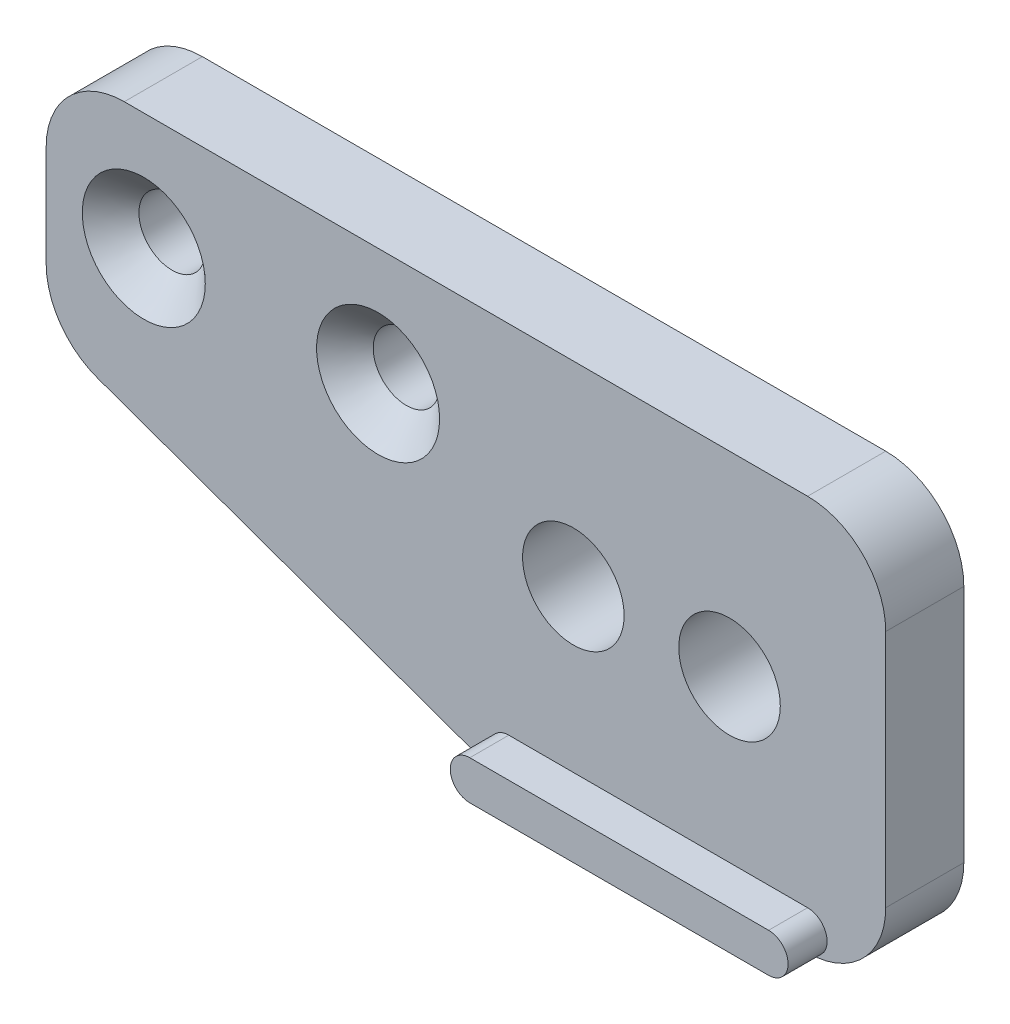
ISO-10303-21;
HEADER;
FILE_DESCRIPTION(('STEP AP214'),'2;1');
FILE_NAME('part.step','',(''),(''),'','','');
FILE_SCHEMA(('AUTOMOTIVE_DESIGN { 1 0 10303 214 1 1 1 1 }'));
ENDSEC;
DATA;
#1=APPLICATION_CONTEXT('core data for automotive mechanical design processes');
#2=APPLICATION_PROTOCOL_DEFINITION('international standard','automotive_design',2000,#1);
#3=PRODUCT_CONTEXT('',#1,'mechanical');
#4=PRODUCT('Part','Part','',(#3));
#5=PRODUCT_RELATED_PRODUCT_CATEGORY('part','',(#4));
#6=PRODUCT_DEFINITION_FORMATION('','',#4);
#7=PRODUCT_DEFINITION_CONTEXT('part definition',#1,'design');
#8=PRODUCT_DEFINITION('design','',#6,#7);
#9=PRODUCT_DEFINITION_SHAPE('','',#8);
#10=(LENGTH_UNIT() NAMED_UNIT(*) SI_UNIT(.MILLI.,.METRE.));
#11=(NAMED_UNIT(*) PLANE_ANGLE_UNIT() SI_UNIT($,.RADIAN.));
#12=(NAMED_UNIT(*) SI_UNIT($,.STERADIAN.) SOLID_ANGLE_UNIT());
#13=UNCERTAINTY_MEASURE_WITH_UNIT(LENGTH_MEASURE(1.E-05),#10,'distance_accuracy_value','');
#14=(GEOMETRIC_REPRESENTATION_CONTEXT(3) GLOBAL_UNCERTAINTY_ASSIGNED_CONTEXT((#13)) GLOBAL_UNIT_ASSIGNED_CONTEXT((#10,
#11,#12)) REPRESENTATION_CONTEXT('',''));
#15=CARTESIAN_POINT('',(0.,0.,0.));
#16=DIRECTION('',(0.,0.,1.));
#17=DIRECTION('',(1.,0.,0.));
#18=AXIS2_PLACEMENT_3D('',#15,#16,#17);
#19=CARTESIAN_POINT('',(6.69569085557666,-10.25,4.));
#20=DIRECTION('',(0.,0.,1.));
#21=DIRECTION('',(1.,0.,0.));
#22=AXIS2_PLACEMENT_3D('',#19,#20,#21);
#23=PLANE('',#22);
#24=CARTESIAN_POINT('',(0.,0.,4.));
#25=DIRECTION('',(0.,0.,1.));
#26=DIRECTION('',(1.,0.,0.));
#27=AXIS2_PLACEMENT_3D('',#24,#25,#26);
#28=CIRCLE('',#27,3.15);
#29=CARTESIAN_POINT('',(3.15,0.,4.));
#30=VERTEX_POINT('',#29);
#31=EDGE_CURVE('E521',#30,#30,#28,.T.);
#32=ORIENTED_EDGE('',*,*,#31,.F.);
#33=EDGE_LOOP('',(#32));
#34=FACE_BOUND('',#33,.T.);
#35=CARTESIAN_POINT('',(-12.,0.,4.));
#36=DIRECTION('',(0.,0.,1.));
#37=DIRECTION('',(1.,0.,0.));
#38=AXIS2_PLACEMENT_3D('',#35,#36,#37);
#39=CIRCLE('',#38,3.15);
#40=CARTESIAN_POINT('',(-8.85,0.,4.));
#41=VERTEX_POINT('',#40);
#42=EDGE_CURVE('E510',#41,#41,#39,.T.);
#43=ORIENTED_EDGE('',*,*,#42,.F.);
#44=EDGE_LOOP('',(#43));
#45=FACE_BOUND('',#44,.T.);
#46=DIRECTION('',(-1.,0.,0.));
#47=VECTOR('',#46,1.);
#48=CARTESIAN_POINT('',(0.424242424242435,-12.25,4.));
#49=LINE('',#48,#47);
#50=CARTESIAN_POINT('',(22.,-12.25,4.));
#51=VERTEX_POINT('',#50);
#52=CARTESIAN_POINT('',(6.69569085557665,-12.25,4.));
#53=VERTEX_POINT('',#52);
#54=EDGE_CURVE('E146',#51,#53,#49,.T.);
#55=ORIENTED_EDGE('',*,*,#54,.F.);
#56=CARTESIAN_POINT('',(22.,-13.25,4.));
#57=DIRECTION('',(0.,0.,1.));
#58=DIRECTION('',(1.,0.,0.));
#59=AXIS2_PLACEMENT_3D('',#56,#57,#58);
#60=CIRCLE('',#59,1.);
#61=CARTESIAN_POINT('',(22.,-14.25,4.));
#62=VERTEX_POINT('',#61);
#63=EDGE_CURVE('E41',#51,#62,#60,.F.);
#64=ORIENTED_EDGE('',*,*,#63,.T.);
#65=CARTESIAN_POINT('',(22.,-10.25,4.));
#66=DIRECTION('',(0.,0.,1.));
#67=DIRECTION('',(1.,0.,0.));
#68=AXIS2_PLACEMENT_3D('',#65,#66,#67);
#69=CIRCLE('',#68,4.);
#70=CARTESIAN_POINT('',(26.,-10.25,4.));
#71=VERTEX_POINT('',#70);
#72=EDGE_CURVE('E155',#62,#71,#69,.T.);
#73=ORIENTED_EDGE('',*,*,#72,.T.);
#74=DIRECTION('',(0.,1.,0.));
#75=VECTOR('',#74,1.);
#76=CARTESIAN_POINT('',(26.,-10.25,4.));
#77=LINE('',#76,#75);
#78=CARTESIAN_POINT('',(26.,2.,4.));
#79=VERTEX_POINT('',#78);
#80=EDGE_CURVE('E158',#71,#79,#77,.T.);
#81=ORIENTED_EDGE('',*,*,#80,.T.);
#82=CARTESIAN_POINT('',(22.,2.,4.));
#83=DIRECTION('',(0.,0.,1.));
#84=DIRECTION('',(1.,0.,0.));
#85=AXIS2_PLACEMENT_3D('',#82,#83,#84);
#86=CIRCLE('',#85,4.);
#87=CARTESIAN_POINT('',(22.,6.,4.));
#88=VERTEX_POINT('',#87);
#89=EDGE_CURVE('E168',#79,#88,#86,.T.);
#90=ORIENTED_EDGE('',*,*,#89,.T.);
#91=DIRECTION('',(-1.,0.,0.));
#92=VECTOR('',#91,1.);
#93=CARTESIAN_POINT('',(22.,6.,4.));
#94=LINE('',#93,#92);
#95=CARTESIAN_POINT('',(-13.,6.,4.));
#96=VERTEX_POINT('',#95);
#97=EDGE_CURVE('E170',#88,#96,#94,.T.);
#98=ORIENTED_EDGE('',*,*,#97,.T.);
#99=CARTESIAN_POINT('',(-13.,2.,4.));
#100=DIRECTION('',(0.,0.,1.));
#101=DIRECTION('',(1.,0.,0.));
#102=AXIS2_PLACEMENT_3D('',#99,#100,#101);
#103=CIRCLE('',#102,4.);
#104=CARTESIAN_POINT('',(-17.,2.,4.));
#105=VERTEX_POINT('',#104);
#106=EDGE_CURVE('E172',#96,#105,#103,.T.);
#107=ORIENTED_EDGE('',*,*,#106,.T.);
#108=DIRECTION('',(0.,-1.,0.));
#109=VECTOR('',#108,1.);
#110=CARTESIAN_POINT('',(-17.,2.,4.));
#111=LINE('',#110,#109);
#112=CARTESIAN_POINT('',(-17.,-3.18524132354316,4.));
#113=VERTEX_POINT('',#112);
#114=EDGE_CURVE('E174',#105,#113,#111,.T.);
#115=ORIENTED_EDGE('',*,*,#114,.T.);
#116=CARTESIAN_POINT('',(-13.,-3.18524132354316,4.));
#117=DIRECTION('',(0.,0.,1.));
#118=DIRECTION('',(-1.,0.,0.));
#119=AXIS2_PLACEMENT_3D('',#116,#117,#118);
#120=CIRCLE('',#119,4.);
#121=CARTESIAN_POINT('',(-14.3505293982752,-6.95035358540129,4.));
#122=VERTEX_POINT('',#121);
#123=EDGE_CURVE('E176',#113,#122,#120,.T.);
#124=ORIENTED_EDGE('',*,*,#123,.T.);
#125=DIRECTION('',(0.941278065464532,-0.337632349568799,0.));
#126=VECTOR('',#125,1.);
#127=CARTESIAN_POINT('',(-14.3505293982752,-6.95035358540129,4.));
#128=LINE('',#127,#126);
#129=CARTESIAN_POINT('',(5.34516145730146,-14.0151122618581,4.));
#130=VERTEX_POINT('',#129);
#131=EDGE_CURVE('E48',#122,#130,#128,.T.);
#132=ORIENTED_EDGE('',*,*,#131,.T.);
#133=CARTESIAN_POINT('',(6.69569085557666,-10.25,4.));
#134=DIRECTION('',(0.,0.,1.));
#135=DIRECTION('',(1.,0.,0.));
#136=AXIS2_PLACEMENT_3D('',#133,#134,#135);
#137=CIRCLE('',#136,4.);
#138=CARTESIAN_POINT('',(6.69569085557666,-14.25,4.));
#139=VERTEX_POINT('',#138);
#140=EDGE_CURVE('E233',#139,#130,#137,.F.);
#141=ORIENTED_EDGE('',*,*,#140,.F.);
#142=CARTESIAN_POINT('',(6.69569085557666,-13.25,4.));
#143=DIRECTION('',(0.,0.,1.));
#144=DIRECTION('',(1.,0.,0.));
#145=AXIS2_PLACEMENT_3D('',#142,#143,#144);
#146=CIRCLE('',#145,1.);
#147=EDGE_CURVE('E11',#139,#53,#146,.F.);
#148=ORIENTED_EDGE('',*,*,#147,.T.);
#149=EDGE_LOOP('',(#55,#64,#73,#81,#90,#98,#107,#115,#124,#132,#141,#148));
#150=FACE_BOUND('',#149,.T.);
#151=CARTESIAN_POINT('',(10.,-4.,4.));
#152=DIRECTION('',(0.,0.,1.));
#153=DIRECTION('',(1.,0.,0.));
#154=AXIS2_PLACEMENT_3D('',#151,#152,#153);
#155=CIRCLE('',#154,2.6);
#156=CARTESIAN_POINT('',(12.6,-4.,4.));
#157=VERTEX_POINT('',#156);
#158=EDGE_CURVE('E183',#157,#157,#155,.T.);
#159=ORIENTED_EDGE('',*,*,#158,.F.);
#160=EDGE_LOOP('',(#159));
#161=FACE_BOUND('',#160,.T.);
#162=CARTESIAN_POINT('',(18.,-4.,4.));
#163=DIRECTION('',(0.,0.,1.));
#164=DIRECTION('',(1.,0.,0.));
#165=AXIS2_PLACEMENT_3D('',#162,#163,#164);
#166=CIRCLE('',#165,2.6);
#167=CARTESIAN_POINT('',(20.6,-4.,4.));
#168=VERTEX_POINT('',#167);
#169=EDGE_CURVE('E291',#168,#168,#166,.T.);
#170=ORIENTED_EDGE('',*,*,#169,.F.);
#171=EDGE_LOOP('',(#170));
#172=FACE_BOUND('',#171,.T.);
#173=ADVANCED_FACE('F33',(#34,#45,#150,#161,#172),#23,.T.);
#174=CARTESIAN_POINT('',(6.69569085557666,-10.25,0.));
#175=DIRECTION('',(0.,0.,1.));
#176=DIRECTION('',(1.,0.,0.));
#177=AXIS2_PLACEMENT_3D('',#174,#175,#176);
#178=PLANE('',#177);
#179=CARTESIAN_POINT('',(0.,0.,0.));
#180=DIRECTION('',(0.,0.,1.));
#181=DIRECTION('',(1.,0.,0.));
#182=AXIS2_PLACEMENT_3D('',#179,#180,#181);
#183=CIRCLE('',#182,1.7);
#184=CARTESIAN_POINT('',(1.7,0.,0.));
#185=VERTEX_POINT('',#184);
#186=EDGE_CURVE('E513',#185,#185,#183,.T.);
#187=ORIENTED_EDGE('',*,*,#186,.T.);
#188=EDGE_LOOP('',(#187));
#189=FACE_BOUND('',#188,.T.);
#190=CARTESIAN_POINT('',(-12.,0.,0.));
#191=DIRECTION('',(0.,0.,1.));
#192=DIRECTION('',(1.,0.,0.));
#193=AXIS2_PLACEMENT_3D('',#190,#191,#192);
#194=CIRCLE('',#193,1.7);
#195=CARTESIAN_POINT('',(-10.3,0.,0.));
#196=VERTEX_POINT('',#195);
#197=EDGE_CURVE('E283',#196,#196,#194,.T.);
#198=ORIENTED_EDGE('',*,*,#197,.T.);
#199=EDGE_LOOP('',(#198));
#200=FACE_BOUND('',#199,.T.);
#201=CARTESIAN_POINT('',(10.,-4.,0.));
#202=DIRECTION('',(0.,0.,1.));
#203=DIRECTION('',(1.,0.,0.));
#204=AXIS2_PLACEMENT_3D('',#201,#202,#203);
#205=CIRCLE('',#204,2.6);
#206=CARTESIAN_POINT('',(12.6,-4.,0.));
#207=VERTEX_POINT('',#206);
#208=EDGE_CURVE('E165',#207,#207,#205,.T.);
#209=ORIENTED_EDGE('',*,*,#208,.T.);
#210=EDGE_LOOP('',(#209));
#211=FACE_BOUND('',#210,.T.);
#212=CARTESIAN_POINT('',(6.69569085557666,-10.25,0.));
#213=DIRECTION('',(0.,0.,1.));
#214=DIRECTION('',(1.,0.,0.));
#215=AXIS2_PLACEMENT_3D('',#212,#213,#214);
#216=CIRCLE('',#215,4.);
#217=CARTESIAN_POINT('',(5.34516145730146,-14.0151122618581,0.));
#218=VERTEX_POINT('',#217);
#219=CARTESIAN_POINT('',(6.69569085557666,-14.25,0.));
#220=VERTEX_POINT('',#219);
#221=EDGE_CURVE('E179',#218,#220,#216,.T.);
#222=ORIENTED_EDGE('',*,*,#221,.F.);
#223=DIRECTION('',(0.941278065464532,-0.337632349568799,0.));
#224=VECTOR('',#223,1.);
#225=CARTESIAN_POINT('',(-14.3505293982752,-6.95035358540129,0.));
#226=LINE('',#225,#224);
#227=CARTESIAN_POINT('',(-14.3505293982752,-6.95035358540129,0.));
#228=VERTEX_POINT('',#227);
#229=EDGE_CURVE('E159',#228,#218,#226,.T.);
#230=ORIENTED_EDGE('',*,*,#229,.F.);
#231=CARTESIAN_POINT('',(-13.,-3.18524132354316,0.));
#232=DIRECTION('',(0.,0.,1.));
#233=DIRECTION('',(-1.,0.,0.));
#234=AXIS2_PLACEMENT_3D('',#231,#232,#233);
#235=CIRCLE('',#234,4.);
#236=CARTESIAN_POINT('',(-17.,-3.18524132354316,0.));
#237=VERTEX_POINT('',#236);
#238=EDGE_CURVE('E197',#237,#228,#235,.T.);
#239=ORIENTED_EDGE('',*,*,#238,.F.);
#240=DIRECTION('',(0.,-1.,0.));
#241=VECTOR('',#240,1.);
#242=CARTESIAN_POINT('',(-17.,2.,0.));
#243=LINE('',#242,#241);
#244=CARTESIAN_POINT('',(-17.,2.,0.));
#245=VERTEX_POINT('',#244);
#246=EDGE_CURVE('E195',#245,#237,#243,.T.);
#247=ORIENTED_EDGE('',*,*,#246,.F.);
#248=CARTESIAN_POINT('',(-13.,2.,0.));
#249=DIRECTION('',(0.,0.,1.));
#250=DIRECTION('',(1.,0.,0.));
#251=AXIS2_PLACEMENT_3D('',#248,#249,#250);
#252=CIRCLE('',#251,4.);
#253=CARTESIAN_POINT('',(-13.,6.,0.));
#254=VERTEX_POINT('',#253);
#255=EDGE_CURVE('E193',#254,#245,#252,.T.);
#256=ORIENTED_EDGE('',*,*,#255,.F.);
#257=DIRECTION('',(-1.,0.,0.));
#258=VECTOR('',#257,1.);
#259=CARTESIAN_POINT('',(22.,6.,0.));
#260=LINE('',#259,#258);
#261=CARTESIAN_POINT('',(22.,6.,0.));
#262=VERTEX_POINT('',#261);
#263=EDGE_CURVE('E191',#262,#254,#260,.T.);
#264=ORIENTED_EDGE('',*,*,#263,.F.);
#265=CARTESIAN_POINT('',(22.,2.,0.));
#266=DIRECTION('',(0.,0.,1.));
#267=DIRECTION('',(1.,0.,0.));
#268=AXIS2_PLACEMENT_3D('',#265,#266,#267);
#269=CIRCLE('',#268,4.);
#270=CARTESIAN_POINT('',(26.,2.,0.));
#271=VERTEX_POINT('',#270);
#272=EDGE_CURVE('E189',#271,#262,#269,.T.);
#273=ORIENTED_EDGE('',*,*,#272,.F.);
#274=DIRECTION('',(0.,1.,0.));
#275=VECTOR('',#274,1.);
#276=CARTESIAN_POINT('',(26.,-10.25,0.));
#277=LINE('',#276,#275);
#278=CARTESIAN_POINT('',(26.,-10.25,0.));
#279=VERTEX_POINT('',#278);
#280=EDGE_CURVE('E187',#279,#271,#277,.T.);
#281=ORIENTED_EDGE('',*,*,#280,.F.);
#282=CARTESIAN_POINT('',(22.,-10.25,0.));
#283=DIRECTION('',(0.,0.,1.));
#284=DIRECTION('',(1.,0.,0.));
#285=AXIS2_PLACEMENT_3D('',#282,#283,#284);
#286=CIRCLE('',#285,4.);
#287=CARTESIAN_POINT('',(22.,-14.25,0.));
#288=VERTEX_POINT('',#287);
#289=EDGE_CURVE('E185',#288,#279,#286,.T.);
#290=ORIENTED_EDGE('',*,*,#289,.F.);
#291=DIRECTION('',(1.,0.,0.));
#292=VECTOR('',#291,1.);
#293=CARTESIAN_POINT('',(6.69569085557666,-14.25,0.));
#294=LINE('',#293,#292);
#295=EDGE_CURVE('E182',#220,#288,#294,.T.);
#296=ORIENTED_EDGE('',*,*,#295,.F.);
#297=EDGE_LOOP('',(#222,#230,#239,#247,#256,#264,#273,#281,#290,#296));
#298=FACE_BOUND('',#297,.T.);
#299=CARTESIAN_POINT('',(18.,-4.,0.));
#300=DIRECTION('',(0.,0.,1.));
#301=DIRECTION('',(1.,0.,0.));
#302=AXIS2_PLACEMENT_3D('',#299,#300,#301);
#303=CIRCLE('',#302,2.6);
#304=CARTESIAN_POINT('',(20.6,-4.,0.));
#305=VERTEX_POINT('',#304);
#306=EDGE_CURVE('E294',#305,#305,#303,.T.);
#307=ORIENTED_EDGE('',*,*,#306,.T.);
#308=EDGE_LOOP('',(#307));
#309=FACE_BOUND('',#308,.T.);
#310=ADVANCED_FACE('F245',(#189,#200,#211,#298,#309),#178,.F.);
#311=CARTESIAN_POINT('',(6.69569085557666,-10.25,4.));
#312=DIRECTION('',(0.,0.,-1.));
#313=DIRECTION('',(-1.,0.,0.));
#314=AXIS2_PLACEMENT_3D('',#311,#312,#313);
#315=CYLINDRICAL_SURFACE('',#314,4.);
#316=DIRECTION('',(0.,0.,-1.));
#317=VECTOR('',#316,1.);
#318=CARTESIAN_POINT('',(6.69569085557666,-14.25,4.));
#319=LINE('',#318,#317);
#320=EDGE_CURVE('E149',#139,#220,#319,.T.);
#321=ORIENTED_EDGE('',*,*,#320,.F.);
#322=ORIENTED_EDGE('',*,*,#140,.T.);
#323=DIRECTION('',(0.,0.,-1.));
#324=VECTOR('',#323,1.);
#325=CARTESIAN_POINT('',(5.34516145730146,-14.0151122618581,4.));
#326=LINE('',#325,#324);
#327=EDGE_CURVE('E201',#130,#218,#326,.T.);
#328=ORIENTED_EDGE('',*,*,#327,.T.);
#329=ORIENTED_EDGE('',*,*,#221,.T.);
#330=EDGE_LOOP('',(#321,#322,#328,#329));
#331=FACE_BOUND('',#330,.T.);
#332=ADVANCED_FACE('F280',(#331),#315,.T.);
#333=CARTESIAN_POINT('',(6.69569085557666,-14.25,4.));
#334=DIRECTION('',(0.,1.,0.));
#335=DIRECTION('',(-1.,0.,0.));
#336=AXIS2_PLACEMENT_3D('',#333,#334,#335);
#337=PLANE('',#336);
#338=ORIENTED_EDGE('',*,*,#295,.T.);
#339=DIRECTION('',(0.,0.,-1.));
#340=VECTOR('',#339,1.);
#341=CARTESIAN_POINT('',(22.,-14.25,4.));
#342=LINE('',#341,#340);
#343=EDGE_CURVE('E222',#62,#288,#342,.T.);
#344=ORIENTED_EDGE('',*,*,#343,.F.);
#345=CARTESIAN_POINT('',(22.,-14.25,6.));
#346=VERTEX_POINT('',#345);
#347=EDGE_CURVE('E145',#346,#62,#342,.T.);
#348=ORIENTED_EDGE('',*,*,#347,.F.);
#349=DIRECTION('',(1.,0.,0.));
#350=VECTOR('',#349,1.);
#351=CARTESIAN_POINT('',(6.69569085557666,-14.25,6.));
#352=LINE('',#351,#350);
#353=CARTESIAN_POINT('',(6.69569085557666,-14.25,6.));
#354=VERTEX_POINT('',#353);
#355=EDGE_CURVE('E131',#354,#346,#352,.T.);
#356=ORIENTED_EDGE('',*,*,#355,.F.);
#357=EDGE_CURVE('E142',#354,#139,#319,.T.);
#358=ORIENTED_EDGE('',*,*,#357,.T.);
#359=ORIENTED_EDGE('',*,*,#320,.T.);
#360=EDGE_LOOP('',(#338,#344,#348,#356,#358,#359));
#361=FACE_BOUND('',#360,.T.);
#362=ADVANCED_FACE('F141',(#361),#337,.F.);
#363=CARTESIAN_POINT('',(22.,-10.25,4.));
#364=DIRECTION('',(0.,0.,-1.));
#365=DIRECTION('',(-1.,0.,0.));
#366=AXIS2_PLACEMENT_3D('',#363,#364,#365);
#367=CYLINDRICAL_SURFACE('',#366,4.);
#368=ORIENTED_EDGE('',*,*,#72,.F.);
#369=ORIENTED_EDGE('',*,*,#343,.T.);
#370=ORIENTED_EDGE('',*,*,#289,.T.);
#371=DIRECTION('',(0.,0.,-1.));
#372=VECTOR('',#371,1.);
#373=CARTESIAN_POINT('',(26.,-10.25,4.));
#374=LINE('',#373,#372);
#375=EDGE_CURVE('E220',#71,#279,#374,.T.);
#376=ORIENTED_EDGE('',*,*,#375,.F.);
#377=EDGE_LOOP('',(#368,#369,#370,#376));
#378=FACE_BOUND('',#377,.T.);
#379=ADVANCED_FACE('F248',(#378),#367,.T.);
#380=CARTESIAN_POINT('',(26.,-10.25,4.));
#381=DIRECTION('',(-1.,0.,0.));
#382=DIRECTION('',(0.,-1.,0.));
#383=AXIS2_PLACEMENT_3D('',#380,#381,#382);
#384=PLANE('',#383);
#385=ORIENTED_EDGE('',*,*,#280,.T.);
#386=DIRECTION('',(0.,0.,-1.));
#387=VECTOR('',#386,1.);
#388=CARTESIAN_POINT('',(26.,2.,4.));
#389=LINE('',#388,#387);
#390=EDGE_CURVE('E218',#79,#271,#389,.T.);
#391=ORIENTED_EDGE('',*,*,#390,.F.);
#392=ORIENTED_EDGE('',*,*,#80,.F.);
#393=ORIENTED_EDGE('',*,*,#375,.T.);
#394=EDGE_LOOP('',(#385,#391,#392,#393));
#395=FACE_BOUND('',#394,.T.);
#396=ADVANCED_FACE('F250',(#395),#384,.F.);
#397=CARTESIAN_POINT('',(22.,2.,4.));
#398=DIRECTION('',(0.,0.,-1.));
#399=DIRECTION('',(-1.,0.,0.));
#400=AXIS2_PLACEMENT_3D('',#397,#398,#399);
#401=CYLINDRICAL_SURFACE('',#400,4.);
#402=ORIENTED_EDGE('',*,*,#272,.T.);
#403=DIRECTION('',(0.,0.,-1.));
#404=VECTOR('',#403,1.);
#405=CARTESIAN_POINT('',(22.,6.,4.));
#406=LINE('',#405,#404);
#407=EDGE_CURVE('E215',#88,#262,#406,.T.);
#408=ORIENTED_EDGE('',*,*,#407,.F.);
#409=ORIENTED_EDGE('',*,*,#89,.F.);
#410=ORIENTED_EDGE('',*,*,#390,.T.);
#411=EDGE_LOOP('',(#402,#408,#409,#410));
#412=FACE_BOUND('',#411,.T.);
#413=ADVANCED_FACE('F256',(#412),#401,.T.);
#414=CARTESIAN_POINT('',(22.,6.,4.));
#415=DIRECTION('',(0.,-1.,0.));
#416=DIRECTION('',(1.,0.,0.));
#417=AXIS2_PLACEMENT_3D('',#414,#415,#416);
#418=PLANE('',#417);
#419=ORIENTED_EDGE('',*,*,#263,.T.);
#420=DIRECTION('',(0.,0.,-1.));
#421=VECTOR('',#420,1.);
#422=CARTESIAN_POINT('',(-13.,6.,4.));
#423=LINE('',#422,#421);
#424=EDGE_CURVE('E212',#96,#254,#423,.T.);
#425=ORIENTED_EDGE('',*,*,#424,.F.);
#426=ORIENTED_EDGE('',*,*,#97,.F.);
#427=ORIENTED_EDGE('',*,*,#407,.T.);
#428=EDGE_LOOP('',(#419,#425,#426,#427));
#429=FACE_BOUND('',#428,.T.);
#430=ADVANCED_FACE('F259',(#429),#418,.F.);
#431=CARTESIAN_POINT('',(-13.,2.,4.));
#432=DIRECTION('',(0.,0.,-1.));
#433=DIRECTION('',(-1.,0.,0.));
#434=AXIS2_PLACEMENT_3D('',#431,#432,#433);
#435=CYLINDRICAL_SURFACE('',#434,4.);
#436=ORIENTED_EDGE('',*,*,#255,.T.);
#437=DIRECTION('',(0.,0.,-1.));
#438=VECTOR('',#437,1.);
#439=CARTESIAN_POINT('',(-17.,2.,4.));
#440=LINE('',#439,#438);
#441=EDGE_CURVE('E209',#105,#245,#440,.T.);
#442=ORIENTED_EDGE('',*,*,#441,.F.);
#443=ORIENTED_EDGE('',*,*,#106,.F.);
#444=ORIENTED_EDGE('',*,*,#424,.T.);
#445=EDGE_LOOP('',(#436,#442,#443,#444));
#446=FACE_BOUND('',#445,.T.);
#447=ADVANCED_FACE('F264',(#446),#435,.T.);
#448=CARTESIAN_POINT('',(-17.,2.,4.));
#449=DIRECTION('',(1.,0.,0.));
#450=DIRECTION('',(0.,0.,-1.));
#451=AXIS2_PLACEMENT_3D('',#448,#449,#450);
#452=PLANE('',#451);
#453=ORIENTED_EDGE('',*,*,#246,.T.);
#454=DIRECTION('',(0.,0.,-1.));
#455=VECTOR('',#454,1.);
#456=CARTESIAN_POINT('',(-17.,-3.18524132354316,4.));
#457=LINE('',#456,#455);
#458=EDGE_CURVE('E206',#113,#237,#457,.T.);
#459=ORIENTED_EDGE('',*,*,#458,.F.);
#460=ORIENTED_EDGE('',*,*,#114,.F.);
#461=ORIENTED_EDGE('',*,*,#441,.T.);
#462=EDGE_LOOP('',(#453,#459,#460,#461));
#463=FACE_BOUND('',#462,.T.);
#464=ADVANCED_FACE('F270',(#463),#452,.F.);
#465=CARTESIAN_POINT('',(-13.,-3.18524132354316,4.));
#466=DIRECTION('',(0.,0.,-1.));
#467=DIRECTION('',(-1.,0.,0.));
#468=AXIS2_PLACEMENT_3D('',#465,#466,#467);
#469=CYLINDRICAL_SURFACE('',#468,4.);
#470=ORIENTED_EDGE('',*,*,#238,.T.);
#471=DIRECTION('',(0.,0.,-1.));
#472=VECTOR('',#471,1.);
#473=CARTESIAN_POINT('',(-14.3505293982752,-6.95035358540129,4.));
#474=LINE('',#473,#472);
#475=EDGE_CURVE('E203',#122,#228,#474,.T.);
#476=ORIENTED_EDGE('',*,*,#475,.F.);
#477=ORIENTED_EDGE('',*,*,#123,.F.);
#478=ORIENTED_EDGE('',*,*,#458,.T.);
#479=EDGE_LOOP('',(#470,#476,#477,#478));
#480=FACE_BOUND('',#479,.T.);
#481=ADVANCED_FACE('F274',(#480),#469,.T.);
#482=CARTESIAN_POINT('',(-14.3505293982752,-6.95035358540129,4.));
#483=DIRECTION('',(0.337632349568799,0.941278065464532,0.));
#484=DIRECTION('',(-0.941278065464532,0.337632349568799,0.));
#485=AXIS2_PLACEMENT_3D('',#482,#483,#484);
#486=PLANE('',#485);
#487=ORIENTED_EDGE('',*,*,#327,.F.);
#488=ORIENTED_EDGE('',*,*,#131,.F.);
#489=ORIENTED_EDGE('',*,*,#475,.T.);
#490=ORIENTED_EDGE('',*,*,#229,.T.);
#491=EDGE_LOOP('',(#487,#488,#489,#490));
#492=FACE_BOUND('',#491,.T.);
#493=ADVANCED_FACE('F278',(#492),#486,.F.);
#494=CARTESIAN_POINT('',(10.,-4.,4.));
#495=DIRECTION('',(0.,0.,-1.));
#496=DIRECTION('',(-1.,0.,0.));
#497=AXIS2_PLACEMENT_3D('',#494,#495,#496);
#498=CYLINDRICAL_SURFACE('',#497,2.6);
#499=ORIENTED_EDGE('',*,*,#158,.T.);
#500=EDGE_LOOP('',(#499));
#501=FACE_BOUND('',#500,.T.);
#502=ORIENTED_EDGE('',*,*,#208,.F.);
#503=EDGE_LOOP('',(#502));
#504=FACE_BOUND('',#503,.T.);
#505=ADVANCED_FACE('F303',(#501,#504),#498,.F.);
#506=CARTESIAN_POINT('',(18.,-4.,4.));
#507=DIRECTION('',(0.,0.,-1.));
#508=DIRECTION('',(-1.,0.,0.));
#509=AXIS2_PLACEMENT_3D('',#506,#507,#508);
#510=CYLINDRICAL_SURFACE('',#509,2.6);
#511=ORIENTED_EDGE('',*,*,#169,.T.);
#512=EDGE_LOOP('',(#511));
#513=FACE_BOUND('',#512,.T.);
#514=ORIENTED_EDGE('',*,*,#306,.F.);
#515=EDGE_LOOP('',(#514));
#516=FACE_BOUND('',#515,.T.);
#517=ADVANCED_FACE('F305',(#513,#516),#510,.F.);
#518=CARTESIAN_POINT('',(0.424242424242435,-12.25,6.));
#519=DIRECTION('',(0.,-1.,0.));
#520=DIRECTION('',(0.,0.,-1.));
#521=AXIS2_PLACEMENT_3D('',#518,#519,#520);
#522=PLANE('',#521);
#523=DIRECTION('',(-1.,0.,0.));
#524=VECTOR('',#523,1.);
#525=CARTESIAN_POINT('',(0.424242424242435,-12.25,6.));
#526=LINE('',#525,#524);
#527=CARTESIAN_POINT('',(22.,-12.25,6.));
#528=VERTEX_POINT('',#527);
#529=CARTESIAN_POINT('',(6.69569085557665,-12.25,6.));
#530=VERTEX_POINT('',#529);
#531=EDGE_CURVE('E134',#528,#530,#526,.T.);
#532=ORIENTED_EDGE('',*,*,#531,.F.);
#533=DIRECTION('',(0.,0.,-1.));
#534=VECTOR('',#533,1.);
#535=CARTESIAN_POINT('',(22.,-12.25,6.));
#536=LINE('',#535,#534);
#537=EDGE_CURVE('E136',#528,#51,#536,.T.);
#538=ORIENTED_EDGE('',*,*,#537,.T.);
#539=ORIENTED_EDGE('',*,*,#54,.T.);
#540=DIRECTION('',(0.,0.,-1.));
#541=VECTOR('',#540,1.);
#542=CARTESIAN_POINT('',(6.69569085557666,-12.25,6.));
#543=LINE('',#542,#541);
#544=EDGE_CURVE('E148',#53,#530,#543,.F.);
#545=ORIENTED_EDGE('',*,*,#544,.T.);
#546=EDGE_LOOP('',(#532,#538,#539,#545));
#547=FACE_BOUND('',#546,.T.);
#548=ADVANCED_FACE('F282',(#547),#522,.F.);
#549=CARTESIAN_POINT('',(6.69569085557666,-10.25,6.));
#550=DIRECTION('',(0.,0.,1.));
#551=DIRECTION('',(1.,0.,0.));
#552=AXIS2_PLACEMENT_3D('',#549,#550,#551);
#553=PLANE('',#552);
#554=ORIENTED_EDGE('',*,*,#355,.T.);
#555=CARTESIAN_POINT('',(22.,-13.25,6.));
#556=DIRECTION('',(0.,0.,1.));
#557=DIRECTION('',(1.,0.,0.));
#558=AXIS2_PLACEMENT_3D('',#555,#556,#557);
#559=CIRCLE('',#558,1.);
#560=EDGE_CURVE('E135',#346,#528,#559,.T.);
#561=ORIENTED_EDGE('',*,*,#560,.T.);
#562=ORIENTED_EDGE('',*,*,#531,.T.);
#563=CARTESIAN_POINT('',(6.69569085557666,-13.25,6.));
#564=DIRECTION('',(0.,0.,1.));
#565=DIRECTION('',(1.,0.,0.));
#566=AXIS2_PLACEMENT_3D('',#563,#564,#565);
#567=CIRCLE('',#566,1.);
#568=EDGE_CURVE('E128',#530,#354,#567,.T.);
#569=ORIENTED_EDGE('',*,*,#568,.T.);
#570=EDGE_LOOP('',(#554,#561,#562,#569));
#571=FACE_BOUND('',#570,.T.);
#572=ADVANCED_FACE('F130',(#571),#553,.T.);
#573=CARTESIAN_POINT('',(-12.,0.,4.));
#574=DIRECTION('',(0.,0.,1.));
#575=DIRECTION('',(1.,0.,0.));
#576=AXIS2_PLACEMENT_3D('',#573,#574,#575);
#577=CYLINDRICAL_SURFACE('',#576,1.7);
#578=ORIENTED_EDGE('',*,*,#197,.F.);
#579=EDGE_LOOP('',(#578));
#580=FACE_BOUND('',#579,.T.);
#581=CARTESIAN_POINT('',(-12.,0.,2.55));
#582=DIRECTION('',(0.,0.,1.));
#583=DIRECTION('',(1.,0.,0.));
#584=AXIS2_PLACEMENT_3D('',#581,#582,#583);
#585=CIRCLE('',#584,1.7);
#586=CARTESIAN_POINT('',(-10.3,0.,2.55));
#587=VERTEX_POINT('',#586);
#588=EDGE_CURVE('E285',#587,#587,#585,.T.);
#589=ORIENTED_EDGE('',*,*,#588,.T.);
#590=EDGE_LOOP('',(#589));
#591=FACE_BOUND('',#590,.T.);
#592=ADVANCED_FACE('F362',(#580,#591),#577,.F.);
#593=CARTESIAN_POINT('',(-12.,0.,4.));
#594=DIRECTION('',(0.,0.,1.));
#595=DIRECTION('',(1.,0.,0.));
#596=AXIS2_PLACEMENT_3D('',#593,#594,#595);
#597=CONICAL_SURFACE('',#596,3.15,0.785398163397448);
#598=ORIENTED_EDGE('',*,*,#588,.F.);
#599=EDGE_LOOP('',(#598));
#600=FACE_BOUND('',#599,.T.);
#601=ORIENTED_EDGE('',*,*,#42,.T.);
#602=EDGE_LOOP('',(#601));
#603=FACE_BOUND('',#602,.T.);
#604=ADVANCED_FACE('F354',(#600,#603),#597,.F.);
#605=CARTESIAN_POINT('',(0.,0.,4.));
#606=DIRECTION('',(0.,0.,1.));
#607=DIRECTION('',(1.,0.,0.));
#608=AXIS2_PLACEMENT_3D('',#605,#606,#607);
#609=CYLINDRICAL_SURFACE('',#608,1.7);
#610=ORIENTED_EDGE('',*,*,#186,.F.);
#611=EDGE_LOOP('',(#610));
#612=FACE_BOUND('',#611,.T.);
#613=CARTESIAN_POINT('',(0.,0.,2.55));
#614=DIRECTION('',(0.,0.,1.));
#615=DIRECTION('',(1.,0.,0.));
#616=AXIS2_PLACEMENT_3D('',#613,#614,#615);
#617=CIRCLE('',#616,1.7);
#618=CARTESIAN_POINT('',(1.7,0.,2.55));
#619=VERTEX_POINT('',#618);
#620=EDGE_CURVE('E518',#619,#619,#617,.T.);
#621=ORIENTED_EDGE('',*,*,#620,.T.);
#622=EDGE_LOOP('',(#621));
#623=FACE_BOUND('',#622,.T.);
#624=ADVANCED_FACE('F348',(#612,#623),#609,.F.);
#625=CARTESIAN_POINT('',(0.,0.,4.));
#626=DIRECTION('',(0.,0.,1.));
#627=DIRECTION('',(1.,0.,0.));
#628=AXIS2_PLACEMENT_3D('',#625,#626,#627);
#629=CONICAL_SURFACE('',#628,3.15,0.785398163397448);
#630=ORIENTED_EDGE('',*,*,#620,.F.);
#631=EDGE_LOOP('',(#630));
#632=FACE_BOUND('',#631,.T.);
#633=ORIENTED_EDGE('',*,*,#31,.T.);
#634=EDGE_LOOP('',(#633));
#635=FACE_BOUND('',#634,.T.);
#636=ADVANCED_FACE('F343',(#632,#635),#629,.F.);
#637=CARTESIAN_POINT('',(22.,-13.25,4.));
#638=DIRECTION('',(0.,0.,-1.));
#639=DIRECTION('',(-1.,0.,0.));
#640=AXIS2_PLACEMENT_3D('',#637,#638,#639);
#641=CYLINDRICAL_SURFACE('',#640,1.);
#642=ORIENTED_EDGE('',*,*,#560,.F.);
#643=ORIENTED_EDGE('',*,*,#347,.T.);
#644=ORIENTED_EDGE('',*,*,#63,.F.);
#645=ORIENTED_EDGE('',*,*,#537,.F.);
#646=EDGE_LOOP('',(#642,#643,#644,#645));
#647=FACE_BOUND('',#646,.T.);
#648=ADVANCED_FACE('F229',(#647),#641,.T.);
#649=CARTESIAN_POINT('',(6.69569085557666,-13.25,4.));
#650=DIRECTION('',(0.,0.,-1.));
#651=DIRECTION('',(-1.,0.,0.));
#652=AXIS2_PLACEMENT_3D('',#649,#650,#651);
#653=CYLINDRICAL_SURFACE('',#652,1.);
#654=ORIENTED_EDGE('',*,*,#568,.F.);
#655=ORIENTED_EDGE('',*,*,#544,.F.);
#656=ORIENTED_EDGE('',*,*,#147,.F.);
#657=ORIENTED_EDGE('',*,*,#357,.F.);
#658=EDGE_LOOP('',(#654,#655,#656,#657));
#659=FACE_BOUND('',#658,.T.);
#660=ADVANCED_FACE('F35',(#659),#653,.T.);
#661=CLOSED_SHELL('',(#173,#310,#332,#362,#379,#396,#413,#430,#447,#464,#481,#493,#505,#517,
#548,#572,#592,#604,#624,#636,#648,#660));
#662=MANIFOLD_SOLID_BREP('B2',#661);
#663=ADVANCED_BREP_SHAPE_REPRESENTATION('',(#18,#662),#14);
#664=SHAPE_DEFINITION_REPRESENTATION(#9,#663);
ENDSEC;
END-ISO-10303-21;
